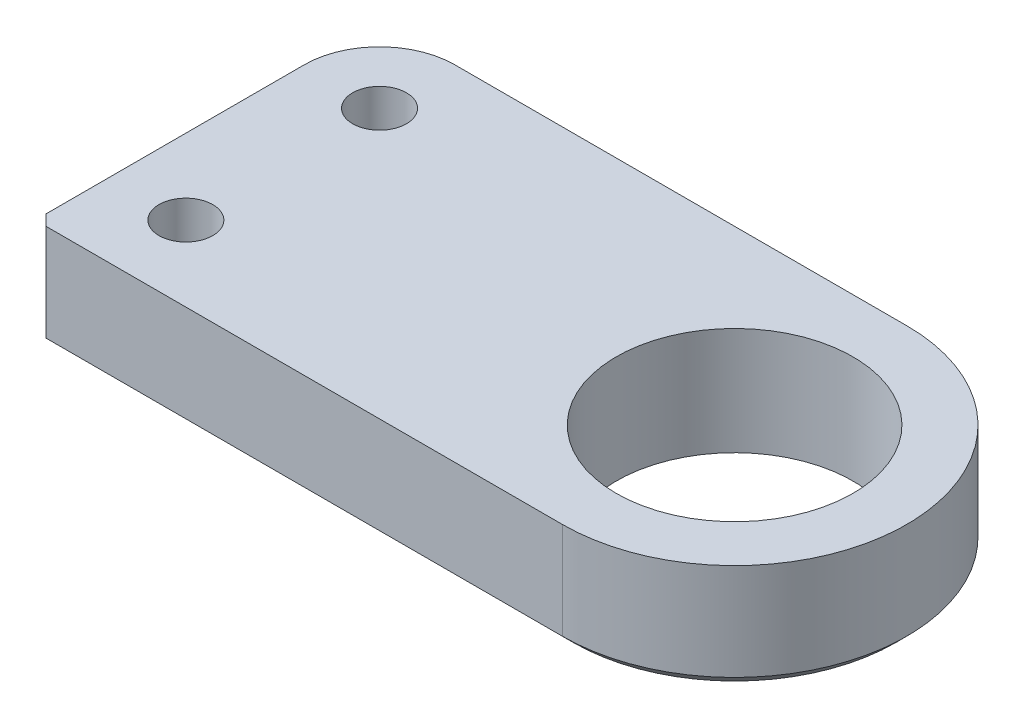
ISO-10303-21;
HEADER;
FILE_DESCRIPTION(('STEP AP214'),'2;1');
FILE_NAME('part.step','',(''),(''),'','','');
FILE_SCHEMA(('AUTOMOTIVE_DESIGN { 1 0 10303 214 1 1 1 1 }'));
ENDSEC;
DATA;
#1=APPLICATION_CONTEXT('core data for automotive mechanical design processes');
#2=APPLICATION_PROTOCOL_DEFINITION('international standard','automotive_design',2000,#1);
#3=PRODUCT_CONTEXT('',#1,'mechanical');
#4=PRODUCT('Part','Part','',(#3));
#5=PRODUCT_RELATED_PRODUCT_CATEGORY('part','',(#4));
#6=PRODUCT_DEFINITION_FORMATION('','',#4);
#7=PRODUCT_DEFINITION_CONTEXT('part definition',#1,'design');
#8=PRODUCT_DEFINITION('design','',#6,#7);
#9=PRODUCT_DEFINITION_SHAPE('','',#8);
#10=(LENGTH_UNIT() NAMED_UNIT(*) SI_UNIT(.MILLI.,.METRE.));
#11=(NAMED_UNIT(*) PLANE_ANGLE_UNIT() SI_UNIT($,.RADIAN.));
#12=(NAMED_UNIT(*) SI_UNIT($,.STERADIAN.) SOLID_ANGLE_UNIT());
#13=UNCERTAINTY_MEASURE_WITH_UNIT(LENGTH_MEASURE(1.E-05),#10,'distance_accuracy_value','');
#14=(GEOMETRIC_REPRESENTATION_CONTEXT(3) GLOBAL_UNCERTAINTY_ASSIGNED_CONTEXT((#13)) GLOBAL_UNIT_ASSIGNED_CONTEXT((#10,
#11,#12)) REPRESENTATION_CONTEXT('',''));
#15=CARTESIAN_POINT('',(0.,0.,0.));
#16=DIRECTION('',(0.,0.,1.));
#17=DIRECTION('',(1.,0.,0.));
#18=AXIS2_PLACEMENT_3D('',#15,#16,#17);
#19=CARTESIAN_POINT('',(0.,10.,0.));
#20=DIRECTION('',(0.,-1.,0.));
#21=DIRECTION('',(0.,0.,-1.));
#22=AXIS2_PLACEMENT_3D('',#19,#20,#21);
#23=PLANE('',#22);
#24=CARTESIAN_POINT('',(0.,10.,0.));
#25=DIRECTION('',(0.,1.,0.));
#26=DIRECTION('',(0.,0.,-1.));
#27=AXIS2_PLACEMENT_3D('',#24,#25,#26);
#28=CIRCLE('',#27,16.);
#29=CARTESIAN_POINT('',(0.,10.,16.));
#30=VERTEX_POINT('',#29);
#31=CARTESIAN_POINT('',(0.,10.,-16.));
#32=VERTEX_POINT('',#31);
#33=EDGE_CURVE('E118',#30,#32,#28,.T.);
#34=ORIENTED_EDGE('',*,*,#33,.T.);
#35=DIRECTION('',(-1.,0.,0.));
#36=VECTOR('',#35,1.);
#37=CARTESIAN_POINT('',(0.,10.,-16.));
#38=LINE('',#37,#36);
#39=CARTESIAN_POINT('',(-42.,10.,-16.));
#40=VERTEX_POINT('',#39);
#41=EDGE_CURVE('E109',#32,#40,#38,.T.);
#42=ORIENTED_EDGE('',*,*,#41,.T.);
#43=CARTESIAN_POINT('',(-42.,10.,-9.00000000000001));
#44=DIRECTION('',(0.,1.,0.));
#45=DIRECTION('',(0.,0.,1.));
#46=AXIS2_PLACEMENT_3D('',#43,#44,#45);
#47=CIRCLE('',#46,7.);
#48=CARTESIAN_POINT('',(-49.,10.,-8.99999999999996));
#49=VERTEX_POINT('',#48);
#50=EDGE_CURVE('E117',#40,#49,#47,.T.);
#51=ORIENTED_EDGE('',*,*,#50,.T.);
#52=DIRECTION('',(0.,0.,1.));
#53=VECTOR('',#52,1.);
#54=CARTESIAN_POINT('',(-49.,10.,-8.99999999999995));
#55=LINE('',#54,#53);
#56=CARTESIAN_POINT('',(-49.,10.,15.));
#57=VERTEX_POINT('',#56);
#58=EDGE_CURVE('E195',#49,#57,#55,.T.);
#59=ORIENTED_EDGE('',*,*,#58,.T.);
#60=DIRECTION('',(0.707106781186547,0.,0.707106781186547));
#61=VECTOR('',#60,1.);
#62=CARTESIAN_POINT('',(-48.,10.,16.));
#63=LINE('',#62,#61);
#64=CARTESIAN_POINT('',(-48.,10.,16.));
#65=VERTEX_POINT('',#64);
#66=EDGE_CURVE('E197',#57,#65,#63,.T.);
#67=ORIENTED_EDGE('',*,*,#66,.T.);
#68=DIRECTION('',(1.,0.,0.));
#69=VECTOR('',#68,1.);
#70=CARTESIAN_POINT('',(0.,10.,16.));
#71=LINE('',#70,#69);
#72=EDGE_CURVE('E123',#65,#30,#71,.T.);
#73=ORIENTED_EDGE('',*,*,#72,.T.);
#74=EDGE_LOOP('',(#34,#42,#51,#59,#67,#73));
#75=FACE_BOUND('',#74,.T.);
#76=CARTESIAN_POINT('',(0.,10.,0.));
#77=DIRECTION('',(0.,1.,0.));
#78=DIRECTION('',(0.,0.,1.));
#79=AXIS2_PLACEMENT_3D('',#76,#77,#78);
#80=CIRCLE('',#79,11.);
#81=CARTESIAN_POINT('',(0.,10.,11.));
#82=VERTEX_POINT('',#81);
#83=EDGE_CURVE('E127',#82,#82,#80,.T.);
#84=ORIENTED_EDGE('',*,*,#83,.F.);
#85=EDGE_LOOP('',(#84));
#86=FACE_BOUND('',#85,.T.);
#87=CARTESIAN_POINT('',(-42.,10.,-9.00000000000002));
#88=DIRECTION('',(0.,1.,0.));
#89=DIRECTION('',(0.,0.,1.));
#90=AXIS2_PLACEMENT_3D('',#87,#88,#89);
#91=CIRCLE('',#90,2.49999999999999);
#92=CARTESIAN_POINT('',(-42.,10.,-6.50000000000002));
#93=VERTEX_POINT('',#92);
#94=EDGE_CURVE('E184',#93,#93,#91,.T.);
#95=ORIENTED_EDGE('',*,*,#94,.F.);
#96=EDGE_LOOP('',(#95));
#97=FACE_BOUND('',#96,.T.);
#98=CARTESIAN_POINT('',(-42.,10.,9.00000000000002));
#99=DIRECTION('',(0.,1.,0.));
#100=DIRECTION('',(0.,0.,1.));
#101=AXIS2_PLACEMENT_3D('',#98,#99,#100);
#102=CIRCLE('',#101,2.49999999999999);
#103=CARTESIAN_POINT('',(-42.,10.,11.5));
#104=VERTEX_POINT('',#103);
#105=EDGE_CURVE('E176',#104,#104,#102,.T.);
#106=ORIENTED_EDGE('',*,*,#105,.F.);
#107=EDGE_LOOP('',(#106));
#108=FACE_BOUND('',#107,.T.);
#109=ADVANCED_FACE('F37',(#75,#86,#97,#108),#23,.F.);
#110=CARTESIAN_POINT('',(0.,0.,0.));
#111=DIRECTION('',(0.,-1.,0.));
#112=DIRECTION('',(0.,0.,-1.));
#113=AXIS2_PLACEMENT_3D('',#110,#111,#112);
#114=PLANE('',#113);
#115=CARTESIAN_POINT('',(0.,0.,0.));
#116=DIRECTION('',(0.,-1.,0.));
#117=DIRECTION('',(0.,0.,-1.));
#118=AXIS2_PLACEMENT_3D('',#115,#116,#117);
#119=CIRCLE('',#118,15.);
#120=CARTESIAN_POINT('',(0.,0.,-15.));
#121=VERTEX_POINT('',#120);
#122=CARTESIAN_POINT('',(0.,0.,15.));
#123=VERTEX_POINT('',#122);
#124=EDGE_CURVE('E146',#121,#123,#119,.T.);
#125=ORIENTED_EDGE('',*,*,#124,.T.);
#126=DIRECTION('',(-1.,0.,0.));
#127=VECTOR('',#126,1.);
#128=CARTESIAN_POINT('',(-48.,0.,15.));
#129=LINE('',#128,#127);
#130=CARTESIAN_POINT('',(-48.,0.,15.));
#131=VERTEX_POINT('',#130);
#132=EDGE_CURVE('E148',#123,#131,#129,.T.);
#133=ORIENTED_EDGE('',*,*,#132,.T.);
#134=DIRECTION('',(0.,0.,-1.));
#135=VECTOR('',#134,1.);
#136=CARTESIAN_POINT('',(-48.,0.,-8.99999999999996));
#137=LINE('',#136,#135);
#138=CARTESIAN_POINT('',(-48.,0.,-8.99999999999996));
#139=VERTEX_POINT('',#138);
#140=EDGE_CURVE('E135',#131,#139,#137,.T.);
#141=ORIENTED_EDGE('',*,*,#140,.T.);
#142=CARTESIAN_POINT('',(-42.,0.,-9.00000000000001));
#143=DIRECTION('',(0.,-1.,0.));
#144=DIRECTION('',(0.,0.,-1.));
#145=AXIS2_PLACEMENT_3D('',#142,#143,#144);
#146=CIRCLE('',#145,5.99999999999999);
#147=CARTESIAN_POINT('',(-42.,0.,-15.));
#148=VERTEX_POINT('',#147);
#149=EDGE_CURVE('E142',#139,#148,#146,.T.);
#150=ORIENTED_EDGE('',*,*,#149,.T.);
#151=DIRECTION('',(1.,0.,0.));
#152=VECTOR('',#151,1.);
#153=CARTESIAN_POINT('',(0.,0.,-15.));
#154=LINE('',#153,#152);
#155=EDGE_CURVE('E144',#148,#121,#154,.T.);
#156=ORIENTED_EDGE('',*,*,#155,.T.);
#157=EDGE_LOOP('',(#125,#133,#141,#150,#156));
#158=FACE_BOUND('',#157,.T.);
#159=CARTESIAN_POINT('',(-42.,0.,-9.00000000000002));
#160=DIRECTION('',(0.,1.,0.));
#161=DIRECTION('',(0.,0.,1.));
#162=AXIS2_PLACEMENT_3D('',#159,#160,#161);
#163=CIRCLE('',#162,2.49999999999999);
#164=CARTESIAN_POINT('',(-42.,0.,-6.50000000000002));
#165=VERTEX_POINT('',#164);
#166=EDGE_CURVE('E181',#165,#165,#163,.T.);
#167=ORIENTED_EDGE('',*,*,#166,.T.);
#168=EDGE_LOOP('',(#167));
#169=FACE_BOUND('',#168,.T.);
#170=CARTESIAN_POINT('',(0.,0.,0.));
#171=DIRECTION('',(0.,1.,0.));
#172=DIRECTION('',(0.,0.,1.));
#173=AXIS2_PLACEMENT_3D('',#170,#171,#172);
#174=CIRCLE('',#173,11.);
#175=CARTESIAN_POINT('',(0.,0.,11.));
#176=VERTEX_POINT('',#175);
#177=EDGE_CURVE('E187',#176,#176,#174,.T.);
#178=ORIENTED_EDGE('',*,*,#177,.T.);
#179=EDGE_LOOP('',(#178));
#180=FACE_BOUND('',#179,.T.);
#181=CARTESIAN_POINT('',(-42.,0.,9.00000000000002));
#182=DIRECTION('',(0.,1.,0.));
#183=DIRECTION('',(0.,0.,1.));
#184=AXIS2_PLACEMENT_3D('',#181,#182,#183);
#185=CIRCLE('',#184,2.49999999999999);
#186=CARTESIAN_POINT('',(-42.,0.,11.5));
#187=VERTEX_POINT('',#186);
#188=EDGE_CURVE('E171',#187,#187,#185,.T.);
#189=ORIENTED_EDGE('',*,*,#188,.T.);
#190=EDGE_LOOP('',(#189));
#191=FACE_BOUND('',#190,.T.);
#192=ADVANCED_FACE('F231',(#158,#169,#180,#191),#114,.T.);
#193=CARTESIAN_POINT('',(0.,10.,0.));
#194=DIRECTION('',(0.,-1.,0.));
#195=DIRECTION('',(0.,0.,-1.));
#196=AXIS2_PLACEMENT_3D('',#193,#194,#195);
#197=CYLINDRICAL_SURFACE('',#196,16.);
#198=DIRECTION('',(0.,-1.,0.));
#199=VECTOR('',#198,1.);
#200=CARTESIAN_POINT('',(0.,10.,16.));
#201=LINE('',#200,#199);
#202=CARTESIAN_POINT('',(0.,1.,16.));
#203=VERTEX_POINT('',#202);
#204=EDGE_CURVE('E200',#30,#203,#201,.T.);
#205=ORIENTED_EDGE('',*,*,#204,.T.);
#206=CARTESIAN_POINT('',(0.,1.,0.));
#207=DIRECTION('',(0.,-1.,0.));
#208=DIRECTION('',(0.,0.,-1.));
#209=AXIS2_PLACEMENT_3D('',#206,#207,#208);
#210=CIRCLE('',#209,16.);
#211=CARTESIAN_POINT('',(0.,1.,-16.));
#212=VERTEX_POINT('',#211);
#213=EDGE_CURVE('E131',#203,#212,#210,.F.);
#214=ORIENTED_EDGE('',*,*,#213,.T.);
#215=DIRECTION('',(0.,-1.,0.));
#216=VECTOR('',#215,1.);
#217=CARTESIAN_POINT('',(0.,10.,-16.));
#218=LINE('',#217,#216);
#219=EDGE_CURVE('E113',#32,#212,#218,.T.);
#220=ORIENTED_EDGE('',*,*,#219,.F.);
#221=ORIENTED_EDGE('',*,*,#33,.F.);
#222=EDGE_LOOP('',(#205,#214,#220,#221));
#223=FACE_BOUND('',#222,.T.);
#224=ADVANCED_FACE('F129',(#223),#197,.T.);
#225=CARTESIAN_POINT('',(0.,10.,-16.));
#226=DIRECTION('',(0.,0.,1.));
#227=DIRECTION('',(1.,0.,0.));
#228=AXIS2_PLACEMENT_3D('',#225,#226,#227);
#229=PLANE('',#228);
#230=ORIENTED_EDGE('',*,*,#219,.T.);
#231=DIRECTION('',(-1.,0.,0.));
#232=VECTOR('',#231,1.);
#233=CARTESIAN_POINT('',(-42.,1.,-16.));
#234=LINE('',#233,#232);
#235=CARTESIAN_POINT('',(-42.,1.,-16.));
#236=VERTEX_POINT('',#235);
#237=EDGE_CURVE('E62',#212,#236,#234,.T.);
#238=ORIENTED_EDGE('',*,*,#237,.T.);
#239=DIRECTION('',(0.,-1.,0.));
#240=VECTOR('',#239,1.);
#241=CARTESIAN_POINT('',(-42.,10.,-16.));
#242=LINE('',#241,#240);
#243=EDGE_CURVE('E114',#40,#236,#242,.T.);
#244=ORIENTED_EDGE('',*,*,#243,.F.);
#245=ORIENTED_EDGE('',*,*,#41,.F.);
#246=EDGE_LOOP('',(#230,#238,#244,#245));
#247=FACE_BOUND('',#246,.T.);
#248=ADVANCED_FACE('F111',(#247),#229,.F.);
#249=CARTESIAN_POINT('',(-42.,10.,-9.00000000000001));
#250=DIRECTION('',(0.,-1.,0.));
#251=DIRECTION('',(0.,0.,-1.));
#252=AXIS2_PLACEMENT_3D('',#249,#250,#251);
#253=CYLINDRICAL_SURFACE('',#252,7.);
#254=ORIENTED_EDGE('',*,*,#243,.T.);
#255=CARTESIAN_POINT('',(-42.,1.,-9.00000000000001));
#256=DIRECTION('',(0.,-1.,0.));
#257=DIRECTION('',(0.,0.,-1.));
#258=AXIS2_PLACEMENT_3D('',#255,#256,#257);
#259=CIRCLE('',#258,7.);
#260=CARTESIAN_POINT('',(-49.,1.,-8.99999999999996));
#261=VERTEX_POINT('',#260);
#262=EDGE_CURVE('E47',#236,#261,#259,.F.);
#263=ORIENTED_EDGE('',*,*,#262,.T.);
#264=DIRECTION('',(0.,-1.,0.));
#265=VECTOR('',#264,1.);
#266=CARTESIAN_POINT('',(-49.,10.,-8.99999999999996));
#267=LINE('',#266,#265);
#268=EDGE_CURVE('E137',#49,#261,#267,.T.);
#269=ORIENTED_EDGE('',*,*,#268,.F.);
#270=ORIENTED_EDGE('',*,*,#50,.F.);
#271=EDGE_LOOP('',(#254,#263,#269,#270));
#272=FACE_BOUND('',#271,.T.);
#273=ADVANCED_FACE('F221',(#272),#253,.T.);
#274=CARTESIAN_POINT('',(-49.,10.,-8.99999999999995));
#275=DIRECTION('',(1.,0.,0.));
#276=DIRECTION('',(0.,0.,-1.));
#277=AXIS2_PLACEMENT_3D('',#274,#275,#276);
#278=PLANE('',#277);
#279=ORIENTED_EDGE('',*,*,#268,.T.);
#280=DIRECTION('',(0.,0.,1.));
#281=VECTOR('',#280,1.);
#282=CARTESIAN_POINT('',(-49.,1.,15.));
#283=LINE('',#282,#281);
#284=CARTESIAN_POINT('',(-49.,1.,15.));
#285=VERTEX_POINT('',#284);
#286=EDGE_CURVE('E11',#261,#285,#283,.T.);
#287=ORIENTED_EDGE('',*,*,#286,.T.);
#288=DIRECTION('',(0.,-1.,0.));
#289=VECTOR('',#288,1.);
#290=CARTESIAN_POINT('',(-49.,10.,15.));
#291=LINE('',#290,#289);
#292=EDGE_CURVE('E205',#57,#285,#291,.T.);
#293=ORIENTED_EDGE('',*,*,#292,.F.);
#294=ORIENTED_EDGE('',*,*,#58,.F.);
#295=EDGE_LOOP('',(#279,#287,#293,#294));
#296=FACE_BOUND('',#295,.T.);
#297=ADVANCED_FACE('F209',(#296),#278,.F.);
#298=CARTESIAN_POINT('',(-48.,10.,16.));
#299=DIRECTION('',(0.707106781186548,0.,-0.707106781186548));
#300=DIRECTION('',(-0.707106781186548,0.,-0.707106781186548));
#301=AXIS2_PLACEMENT_3D('',#298,#299,#300);
#302=PLANE('',#301);
#303=DIRECTION('',(0.577350269189627,-0.577350269189623,0.577350269189627));
#304=VECTOR('',#303,1.);
#305=CARTESIAN_POINT('',(-57.,8.99999999999997,6.99999999999999));
#306=LINE('',#305,#304);
#307=CARTESIAN_POINT('',(-48.5,0.500000000000004,15.5));
#308=VERTEX_POINT('',#307);
#309=EDGE_CURVE('E151',#285,#308,#306,.T.);
#310=ORIENTED_EDGE('',*,*,#309,.T.);
#311=DIRECTION('',(0.577350269189627,0.577350269189623,0.577350269189627));
#312=VECTOR('',#311,1.);
#313=CARTESIAN_POINT('',(-31.9999999999999,17.,32.0000000000001));
#314=LINE('',#313,#312);
#315=CARTESIAN_POINT('',(-48.,1.,16.));
#316=VERTEX_POINT('',#315);
#317=EDGE_CURVE('E153',#308,#316,#314,.T.);
#318=ORIENTED_EDGE('',*,*,#317,.T.);
#319=DIRECTION('',(0.,-1.,0.));
#320=VECTOR('',#319,1.);
#321=CARTESIAN_POINT('',(-48.,10.,16.));
#322=LINE('',#321,#320);
#323=EDGE_CURVE('E202',#65,#316,#322,.T.);
#324=ORIENTED_EDGE('',*,*,#323,.F.);
#325=ORIENTED_EDGE('',*,*,#66,.F.);
#326=ORIENTED_EDGE('',*,*,#292,.T.);
#327=EDGE_LOOP('',(#310,#318,#324,#325,#326));
#328=FACE_BOUND('',#327,.T.);
#329=ADVANCED_FACE('F218',(#328),#302,.F.);
#330=CARTESIAN_POINT('',(0.,10.,16.));
#331=DIRECTION('',(0.,0.,-1.));
#332=DIRECTION('',(-1.,0.,0.));
#333=AXIS2_PLACEMENT_3D('',#330,#331,#332);
#334=PLANE('',#333);
#335=ORIENTED_EDGE('',*,*,#323,.T.);
#336=DIRECTION('',(1.,0.,0.));
#337=VECTOR('',#336,1.);
#338=CARTESIAN_POINT('',(0.,1.,16.));
#339=LINE('',#338,#337);
#340=EDGE_CURVE('E132',#316,#203,#339,.T.);
#341=ORIENTED_EDGE('',*,*,#340,.T.);
#342=ORIENTED_EDGE('',*,*,#204,.F.);
#343=ORIENTED_EDGE('',*,*,#72,.F.);
#344=EDGE_LOOP('',(#335,#341,#342,#343));
#345=FACE_BOUND('',#344,.T.);
#346=ADVANCED_FACE('F242',(#345),#334,.F.);
#347=CARTESIAN_POINT('',(0.,10.,0.));
#348=DIRECTION('',(0.,-1.,0.));
#349=DIRECTION('',(0.,0.,-1.));
#350=AXIS2_PLACEMENT_3D('',#347,#348,#349);
#351=CYLINDRICAL_SURFACE('',#350,11.);
#352=ORIENTED_EDGE('',*,*,#83,.T.);
#353=EDGE_LOOP('',(#352));
#354=FACE_BOUND('',#353,.T.);
#355=ORIENTED_EDGE('',*,*,#177,.F.);
#356=EDGE_LOOP('',(#355));
#357=FACE_BOUND('',#356,.T.);
#358=ADVANCED_FACE('F239',(#354,#357),#351,.F.);
#359=CARTESIAN_POINT('',(-42.,10.,-9.00000000000002));
#360=DIRECTION('',(0.,-1.,0.));
#361=DIRECTION('',(0.,0.,-1.));
#362=AXIS2_PLACEMENT_3D('',#359,#360,#361);
#363=CYLINDRICAL_SURFACE('',#362,2.49999999999999);
#364=ORIENTED_EDGE('',*,*,#94,.T.);
#365=EDGE_LOOP('',(#364));
#366=FACE_BOUND('',#365,.T.);
#367=ORIENTED_EDGE('',*,*,#166,.F.);
#368=EDGE_LOOP('',(#367));
#369=FACE_BOUND('',#368,.T.);
#370=ADVANCED_FACE('F262',(#366,#369),#363,.F.);
#371=CARTESIAN_POINT('',(-42.,10.,9.00000000000002));
#372=DIRECTION('',(0.,-1.,0.));
#373=DIRECTION('',(0.,0.,-1.));
#374=AXIS2_PLACEMENT_3D('',#371,#372,#373);
#375=CYLINDRICAL_SURFACE('',#374,2.49999999999999);
#376=ORIENTED_EDGE('',*,*,#105,.T.);
#377=EDGE_LOOP('',(#376));
#378=FACE_BOUND('',#377,.T.);
#379=ORIENTED_EDGE('',*,*,#188,.F.);
#380=EDGE_LOOP('',(#379));
#381=FACE_BOUND('',#380,.T.);
#382=ADVANCED_FACE('F269',(#378,#381),#375,.F.);
#383=CARTESIAN_POINT('',(-42.,1.,-9.00000000000001));
#384=DIRECTION('',(0.,1.,0.));
#385=DIRECTION('',(0.,0.,1.));
#386=AXIS2_PLACEMENT_3D('',#383,#384,#385);
#387=CONICAL_SURFACE('',#386,7.,0.785398163397452);
#388=DIRECTION('',(0.70710678118655,-0.707106781186545,0.));
#389=VECTOR('',#388,1.);
#390=CARTESIAN_POINT('',(-49.,1.,-8.99999999999996));
#391=LINE('',#390,#389);
#392=EDGE_CURVE('E164',#261,#139,#391,.T.);
#393=ORIENTED_EDGE('',*,*,#392,.F.);
#394=ORIENTED_EDGE('',*,*,#262,.F.);
#395=DIRECTION('',(0.,0.707106781186545,-0.70710678118655));
#396=VECTOR('',#395,1.);
#397=CARTESIAN_POINT('',(-42.,0.,-15.));
#398=LINE('',#397,#396);
#399=EDGE_CURVE('E42',#148,#236,#398,.T.);
#400=ORIENTED_EDGE('',*,*,#399,.F.);
#401=ORIENTED_EDGE('',*,*,#149,.F.);
#402=EDGE_LOOP('',(#393,#394,#400,#401));
#403=FACE_BOUND('',#402,.T.);
#404=ADVANCED_FACE('F40',(#403),#387,.T.);
#405=CARTESIAN_POINT('',(0.,1.,-16.));
#406=DIRECTION('',(0.,-0.70710678118655,-0.707106781186545));
#407=DIRECTION('',(1.,0.,0.));
#408=AXIS2_PLACEMENT_3D('',#405,#406,#407);
#409=PLANE('',#408);
#410=ORIENTED_EDGE('',*,*,#399,.T.);
#411=ORIENTED_EDGE('',*,*,#237,.F.);
#412=DIRECTION('',(0.,0.707106781186545,-0.70710678118655));
#413=VECTOR('',#412,1.);
#414=CARTESIAN_POINT('',(0.,0.,-15.));
#415=LINE('',#414,#413);
#416=EDGE_CURVE('E162',#121,#212,#415,.T.);
#417=ORIENTED_EDGE('',*,*,#416,.F.);
#418=ORIENTED_EDGE('',*,*,#155,.F.);
#419=EDGE_LOOP('',(#410,#411,#417,#418));
#420=FACE_BOUND('',#419,.T.);
#421=ADVANCED_FACE('F283',(#420),#409,.T.);
#422=CARTESIAN_POINT('',(-49.,1.,-8.99999999999995));
#423=DIRECTION('',(-0.707106781186545,-0.70710678118655,0.));
#424=DIRECTION('',(0.,0.,-1.));
#425=AXIS2_PLACEMENT_3D('',#422,#423,#424);
#426=PLANE('',#425);
#427=ORIENTED_EDGE('',*,*,#392,.T.);
#428=ORIENTED_EDGE('',*,*,#140,.F.);
#429=DIRECTION('',(-0.577350269189627,0.577350269189623,0.577350269189627));
#430=VECTOR('',#429,1.);
#431=CARTESIAN_POINT('',(-40.6666666666666,-7.3333333333333,7.66666666666665));
#432=LINE('',#431,#430);
#433=EDGE_CURVE('E160',#308,#131,#432,.F.);
#434=ORIENTED_EDGE('',*,*,#433,.F.);
#435=ORIENTED_EDGE('',*,*,#309,.F.);
#436=ORIENTED_EDGE('',*,*,#286,.F.);
#437=EDGE_LOOP('',(#427,#428,#434,#435,#436));
#438=FACE_BOUND('',#437,.T.);
#439=ADVANCED_FACE('F214',(#438),#426,.T.);
#440=CARTESIAN_POINT('',(0.,1.,0.));
#441=DIRECTION('',(0.,1.,0.));
#442=DIRECTION('',(0.,0.,1.));
#443=AXIS2_PLACEMENT_3D('',#440,#441,#442);
#444=CONICAL_SURFACE('',#443,16.,0.785398163397452);
#445=ORIENTED_EDGE('',*,*,#416,.T.);
#446=ORIENTED_EDGE('',*,*,#213,.F.);
#447=DIRECTION('',(0.,0.707106781186545,0.70710678118655));
#448=VECTOR('',#447,1.);
#449=CARTESIAN_POINT('',(0.,0.,15.));
#450=LINE('',#449,#448);
#451=EDGE_CURVE('E158',#123,#203,#450,.T.);
#452=ORIENTED_EDGE('',*,*,#451,.F.);
#453=ORIENTED_EDGE('',*,*,#124,.F.);
#454=EDGE_LOOP('',(#445,#446,#452,#453));
#455=FACE_BOUND('',#454,.T.);
#456=ADVANCED_FACE('F294',(#455),#444,.T.);
#457=CARTESIAN_POINT('',(0.,1.,16.));
#458=DIRECTION('',(0.,-0.70710678118655,0.707106781186545));
#459=DIRECTION('',(-1.,0.,0.));
#460=AXIS2_PLACEMENT_3D('',#457,#458,#459);
#461=PLANE('',#460);
#462=ORIENTED_EDGE('',*,*,#433,.T.);
#463=ORIENTED_EDGE('',*,*,#132,.F.);
#464=ORIENTED_EDGE('',*,*,#451,.T.);
#465=ORIENTED_EDGE('',*,*,#340,.F.);
#466=ORIENTED_EDGE('',*,*,#317,.F.);
#467=EDGE_LOOP('',(#462,#463,#464,#465,#466));
#468=FACE_BOUND('',#467,.T.);
#469=ADVANCED_FACE('F301',(#468),#461,.T.);
#470=CLOSED_SHELL('',(#109,#192,#224,#248,#273,#297,#329,#346,#358,#370,#382,#404,#421,#439,
#456,#469));
#471=MANIFOLD_SOLID_BREP('B2',#470);
#472=ADVANCED_BREP_SHAPE_REPRESENTATION('',(#18,#471),#14);
#473=SHAPE_DEFINITION_REPRESENTATION(#9,#472);
ENDSEC;
END-ISO-10303-21;
